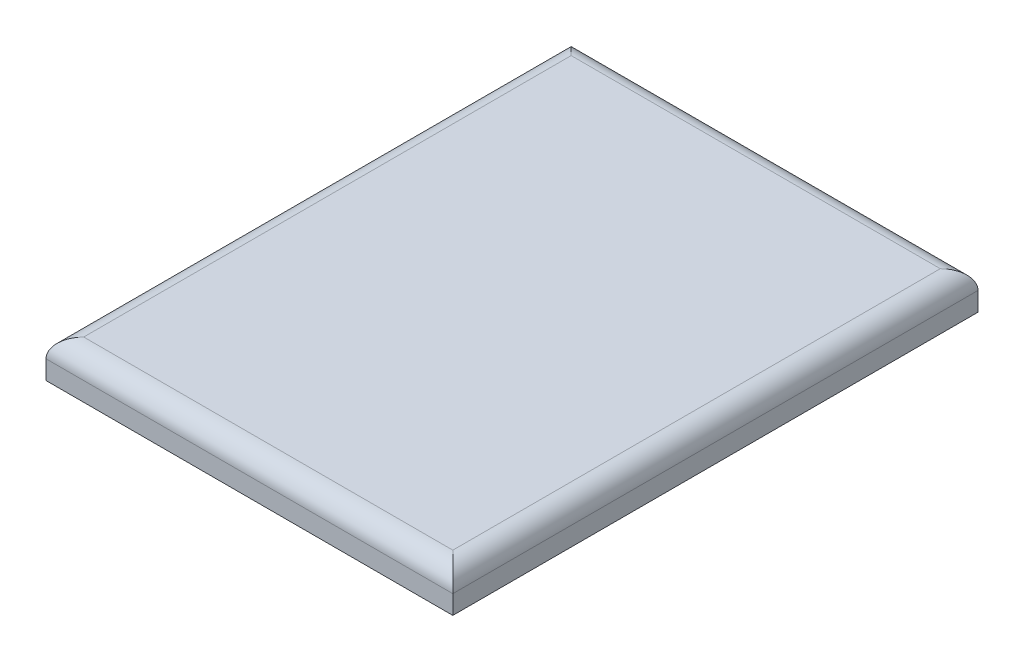
ISO-10303-21;
HEADER;
FILE_DESCRIPTION(('STEP AP214'),'2;1');
FILE_NAME('part.step','',(''),(''),'','','');
FILE_SCHEMA(('AUTOMOTIVE_DESIGN { 1 0 10303 214 1 1 1 1 }'));
ENDSEC;
DATA;
#1=APPLICATION_CONTEXT('core data for automotive mechanical design processes');
#2=APPLICATION_PROTOCOL_DEFINITION('international standard','automotive_design',2000,#1);
#3=PRODUCT_CONTEXT('',#1,'mechanical');
#4=PRODUCT('Part','Part','',(#3));
#5=PRODUCT_RELATED_PRODUCT_CATEGORY('part','',(#4));
#6=PRODUCT_DEFINITION_FORMATION('','',#4);
#7=PRODUCT_DEFINITION_CONTEXT('part definition',#1,'design');
#8=PRODUCT_DEFINITION('design','',#6,#7);
#9=PRODUCT_DEFINITION_SHAPE('','',#8);
#10=(LENGTH_UNIT() NAMED_UNIT(*) SI_UNIT(.MILLI.,.METRE.));
#11=(NAMED_UNIT(*) PLANE_ANGLE_UNIT() SI_UNIT($,.RADIAN.));
#12=(NAMED_UNIT(*) SI_UNIT($,.STERADIAN.) SOLID_ANGLE_UNIT());
#13=UNCERTAINTY_MEASURE_WITH_UNIT(LENGTH_MEASURE(1.E-05),#10,'distance_accuracy_value','');
#14=(GEOMETRIC_REPRESENTATION_CONTEXT(3) GLOBAL_UNCERTAINTY_ASSIGNED_CONTEXT((#13)) GLOBAL_UNIT_ASSIGNED_CONTEXT((#10,
#11,#12)) REPRESENTATION_CONTEXT('',''));
#15=CARTESIAN_POINT('',(0.,0.,0.));
#16=DIRECTION('',(0.,0.,1.));
#17=DIRECTION('',(1.,0.,0.));
#18=AXIS2_PLACEMENT_3D('',#15,#16,#17);
#19=CARTESIAN_POINT('',(215.9,40.0000000000001,278.716444550482));
#20=DIRECTION('',(-1.,0.,0.));
#21=DIRECTION('',(0.,0.,1.));
#22=AXIS2_PLACEMENT_3D('',#19,#20,#21);
#23=PLANE('',#22);
#24=DIRECTION('',(0.,-1.,0.));
#25=VECTOR('',#24,1.);
#26=CARTESIAN_POINT('',(215.9,40.,-278.716444550482));
#27=LINE('',#26,#25);
#28=CARTESIAN_POINT('',(215.9,20.,-278.716444550482));
#29=VERTEX_POINT('',#28);
#30=CARTESIAN_POINT('',(215.9,0.,-278.716444550482));
#31=VERTEX_POINT('',#30);
#32=EDGE_CURVE('E85',#29,#31,#27,.T.);
#33=ORIENTED_EDGE('',*,*,#32,.F.);
#34=DIRECTION('',(0.,0.,-1.));
#35=VECTOR('',#34,1.);
#36=CARTESIAN_POINT('',(215.9,20.,278.716444550482));
#37=LINE('',#36,#35);
#38=CARTESIAN_POINT('',(215.9,20.,278.716444550482));
#39=VERTEX_POINT('',#38);
#40=EDGE_CURVE('E129',#29,#39,#37,.F.);
#41=ORIENTED_EDGE('',*,*,#40,.T.);
#42=DIRECTION('',(0.,-1.,0.));
#43=VECTOR('',#42,1.);
#44=CARTESIAN_POINT('',(215.9,40.0000000000001,278.716444550482));
#45=LINE('',#44,#43);
#46=CARTESIAN_POINT('',(215.9,0.,278.716444550482));
#47=VERTEX_POINT('',#46);
#48=EDGE_CURVE('E105',#39,#47,#45,.T.);
#49=ORIENTED_EDGE('',*,*,#48,.T.);
#50=DIRECTION('',(0.,0.,-1.));
#51=VECTOR('',#50,1.);
#52=CARTESIAN_POINT('',(215.9,0.,278.716444550482));
#53=LINE('',#52,#51);
#54=EDGE_CURVE('E100',#47,#31,#53,.T.);
#55=ORIENTED_EDGE('',*,*,#54,.T.);
#56=EDGE_LOOP('',(#33,#41,#49,#55));
#57=FACE_BOUND('',#56,.T.);
#58=ADVANCED_FACE('F34',(#57),#23,.F.);
#59=CARTESIAN_POINT('',(-215.9,40.,-278.716444550482));
#60=DIRECTION('',(0.,0.,1.));
#61=DIRECTION('',(1.,0.,0.));
#62=AXIS2_PLACEMENT_3D('',#59,#60,#61);
#63=PLANE('',#62);
#64=DIRECTION('',(0.,-1.,0.));
#65=VECTOR('',#64,1.);
#66=CARTESIAN_POINT('',(-215.9,40.,-278.716444550482));
#67=LINE('',#66,#65);
#68=CARTESIAN_POINT('',(-215.9,20.,-278.716444550482));
#69=VERTEX_POINT('',#68);
#70=CARTESIAN_POINT('',(-215.9,0.,-278.716444550482));
#71=VERTEX_POINT('',#70);
#72=EDGE_CURVE('E94',#69,#71,#67,.T.);
#73=ORIENTED_EDGE('',*,*,#72,.F.);
#74=DIRECTION('',(-1.,0.,0.));
#75=VECTOR('',#74,1.);
#76=CARTESIAN_POINT('',(-215.9,20.,-278.716444550482));
#77=LINE('',#76,#75);
#78=EDGE_CURVE('E43',#69,#29,#77,.F.);
#79=ORIENTED_EDGE('',*,*,#78,.T.);
#80=ORIENTED_EDGE('',*,*,#32,.T.);
#81=DIRECTION('',(-1.,0.,0.));
#82=VECTOR('',#81,1.);
#83=CARTESIAN_POINT('',(-215.9,0.,-278.716444550482));
#84=LINE('',#83,#82);
#85=EDGE_CURVE('E88',#31,#71,#84,.T.);
#86=ORIENTED_EDGE('',*,*,#85,.T.);
#87=EDGE_LOOP('',(#73,#79,#80,#86));
#88=FACE_BOUND('',#87,.T.);
#89=ADVANCED_FACE('F87',(#88),#63,.F.);
#90=CARTESIAN_POINT('',(-215.9,40.0000000000001,278.716444550482));
#91=DIRECTION('',(1.,0.,0.));
#92=DIRECTION('',(0.,0.,-1.));
#93=AXIS2_PLACEMENT_3D('',#90,#91,#92);
#94=PLANE('',#93);
#95=DIRECTION('',(0.,-1.,0.));
#96=VECTOR('',#95,1.);
#97=CARTESIAN_POINT('',(-215.9,40.0000000000001,278.716444550482));
#98=LINE('',#97,#96);
#99=CARTESIAN_POINT('',(-215.9,20.,278.716444550482));
#100=VERTEX_POINT('',#99);
#101=CARTESIAN_POINT('',(-215.9,0.,278.716444550482));
#102=VERTEX_POINT('',#101);
#103=EDGE_CURVE('E115',#100,#102,#98,.T.);
#104=ORIENTED_EDGE('',*,*,#103,.F.);
#105=DIRECTION('',(0.,0.,1.));
#106=VECTOR('',#105,1.);
#107=CARTESIAN_POINT('',(-215.9,20.,278.716444550482));
#108=LINE('',#107,#106);
#109=EDGE_CURVE('E11',#100,#69,#108,.F.);
#110=ORIENTED_EDGE('',*,*,#109,.T.);
#111=ORIENTED_EDGE('',*,*,#72,.T.);
#112=DIRECTION('',(0.,0.,1.));
#113=VECTOR('',#112,1.);
#114=CARTESIAN_POINT('',(-215.9,0.,278.716444550482));
#115=LINE('',#114,#113);
#116=EDGE_CURVE('E102',#71,#102,#115,.T.);
#117=ORIENTED_EDGE('',*,*,#116,.T.);
#118=EDGE_LOOP('',(#104,#110,#111,#117));
#119=FACE_BOUND('',#118,.T.);
#120=ADVANCED_FACE('F154',(#119),#94,.F.);
#121=CARTESIAN_POINT('',(-215.9,40.0000000000001,278.716444550482));
#122=DIRECTION('',(0.,0.,-1.));
#123=DIRECTION('',(-1.,0.,0.));
#124=AXIS2_PLACEMENT_3D('',#121,#122,#123);
#125=PLANE('',#124);
#126=ORIENTED_EDGE('',*,*,#48,.F.);
#127=DIRECTION('',(1.,0.,0.));
#128=VECTOR('',#127,1.);
#129=CARTESIAN_POINT('',(-215.9,20.,278.716444550482));
#130=LINE('',#129,#128);
#131=EDGE_CURVE('E126',#39,#100,#130,.F.);
#132=ORIENTED_EDGE('',*,*,#131,.T.);
#133=ORIENTED_EDGE('',*,*,#103,.T.);
#134=DIRECTION('',(1.,0.,0.));
#135=VECTOR('',#134,1.);
#136=CARTESIAN_POINT('',(-215.9,0.,278.716444550482));
#137=LINE('',#136,#135);
#138=EDGE_CURVE('E112',#102,#47,#137,.T.);
#139=ORIENTED_EDGE('',*,*,#138,.T.);
#140=EDGE_LOOP('',(#126,#132,#133,#139));
#141=FACE_BOUND('',#140,.T.);
#142=ADVANCED_FACE('F153',(#141),#125,.F.);
#143=CARTESIAN_POINT('',(0.,40.,0.));
#144=DIRECTION('',(0.,-1.,0.));
#145=DIRECTION('',(0.,0.,-1.));
#146=AXIS2_PLACEMENT_3D('',#143,#144,#145);
#147=PLANE('',#146);
#148=DIRECTION('',(0.,0.,1.));
#149=VECTOR('',#148,1.);
#150=CARTESIAN_POINT('',(-195.9,40.,0.));
#151=LINE('',#150,#149);
#152=CARTESIAN_POINT('',(-195.9,40.,-258.716444550482));
#153=VERTEX_POINT('',#152);
#154=CARTESIAN_POINT('',(-195.9,40.,258.716444550482));
#155=VERTEX_POINT('',#154);
#156=EDGE_CURVE('E93',#153,#155,#151,.T.);
#157=ORIENTED_EDGE('',*,*,#156,.T.);
#158=DIRECTION('',(1.,0.,0.));
#159=VECTOR('',#158,1.);
#160=CARTESIAN_POINT('',(0.,40.,258.716444550482));
#161=LINE('',#160,#159);
#162=CARTESIAN_POINT('',(195.9,40.,258.716444550482));
#163=VERTEX_POINT('',#162);
#164=EDGE_CURVE('E123',#155,#163,#161,.T.);
#165=ORIENTED_EDGE('',*,*,#164,.T.);
#166=DIRECTION('',(0.,0.,-1.));
#167=VECTOR('',#166,1.);
#168=CARTESIAN_POINT('',(195.9,40.,0.));
#169=LINE('',#168,#167);
#170=CARTESIAN_POINT('',(195.9,40.,-258.716444550482));
#171=VERTEX_POINT('',#170);
#172=EDGE_CURVE('E121',#163,#171,#169,.T.);
#173=ORIENTED_EDGE('',*,*,#172,.T.);
#174=DIRECTION('',(-1.,0.,0.));
#175=VECTOR('',#174,1.);
#176=CARTESIAN_POINT('',(0.,40.,-258.716444550482));
#177=LINE('',#176,#175);
#178=EDGE_CURVE('E119',#171,#153,#177,.T.);
#179=ORIENTED_EDGE('',*,*,#178,.T.);
#180=EDGE_LOOP('',(#157,#165,#173,#179));
#181=FACE_BOUND('',#180,.T.);
#182=ADVANCED_FACE('F146',(#181),#147,.F.);
#183=CARTESIAN_POINT('',(0.,0.,0.));
#184=DIRECTION('',(0.,-1.,0.));
#185=DIRECTION('',(0.,0.,-1.));
#186=AXIS2_PLACEMENT_3D('',#183,#184,#185);
#187=PLANE('',#186);
#188=ORIENTED_EDGE('',*,*,#54,.F.);
#189=ORIENTED_EDGE('',*,*,#138,.F.);
#190=ORIENTED_EDGE('',*,*,#116,.F.);
#191=ORIENTED_EDGE('',*,*,#85,.F.);
#192=EDGE_LOOP('',(#188,#189,#190,#191));
#193=FACE_BOUND('',#192,.T.);
#194=ADVANCED_FACE('F98',(#193),#187,.T.);
#195=CARTESIAN_POINT('',(0.,20.,-258.716444550482));
#196=DIRECTION('',(-1.,0.,0.));
#197=DIRECTION('',(0.,0.,1.));
#198=AXIS2_PLACEMENT_3D('',#195,#196,#197);
#199=CYLINDRICAL_SURFACE('',#198,20.);
#200=CARTESIAN_POINT('',(195.9,20.,-258.716444550482));
#201=DIRECTION('',(-0.707106781186547,0.,-0.707106781186548));
#202=DIRECTION('',(-0.707106781186547,0.,0.707106781186548));
#203=AXIS2_PLACEMENT_3D('',#200,#201,#202);
#204=ELLIPSE('',#203,28.2842712474619,20.);
#205=EDGE_CURVE('E109',#29,#171,#204,.F.);
#206=ORIENTED_EDGE('',*,*,#205,.F.);
#207=ORIENTED_EDGE('',*,*,#78,.F.);
#208=CARTESIAN_POINT('',(-195.9,20.,-258.716444550482));
#209=DIRECTION('',(-0.707106781186547,0.,0.707106781186548));
#210=DIRECTION('',(0.707106781186547,0.,0.707106781186548));
#211=AXIS2_PLACEMENT_3D('',#208,#209,#210);
#212=ELLIPSE('',#211,28.2842712474619,20.);
#213=EDGE_CURVE('E38',#153,#69,#212,.T.);
#214=ORIENTED_EDGE('',*,*,#213,.F.);
#215=ORIENTED_EDGE('',*,*,#178,.F.);
#216=EDGE_LOOP('',(#206,#207,#214,#215));
#217=FACE_BOUND('',#216,.T.);
#218=ADVANCED_FACE('F36',(#217),#199,.T.);
#219=CARTESIAN_POINT('',(-195.9,20.,0.));
#220=DIRECTION('',(0.,0.,1.));
#221=DIRECTION('',(1.,0.,0.));
#222=AXIS2_PLACEMENT_3D('',#219,#220,#221);
#223=CYLINDRICAL_SURFACE('',#222,20.);
#224=ORIENTED_EDGE('',*,*,#213,.T.);
#225=ORIENTED_EDGE('',*,*,#109,.F.);
#226=CARTESIAN_POINT('',(-195.9,20.,258.716444550482));
#227=DIRECTION('',(0.707106781186547,0.,0.707106781186548));
#228=DIRECTION('',(-0.707106781186547,0.,0.707106781186548));
#229=AXIS2_PLACEMENT_3D('',#226,#227,#228);
#230=ELLIPSE('',#229,28.2842712474619,20.);
#231=EDGE_CURVE('E134',#155,#100,#230,.T.);
#232=ORIENTED_EDGE('',*,*,#231,.F.);
#233=ORIENTED_EDGE('',*,*,#156,.F.);
#234=EDGE_LOOP('',(#224,#225,#232,#233));
#235=FACE_BOUND('',#234,.T.);
#236=ADVANCED_FACE('F171',(#235),#223,.T.);
#237=CARTESIAN_POINT('',(195.9,20.,0.));
#238=DIRECTION('',(0.,0.,-1.));
#239=DIRECTION('',(-1.,0.,0.));
#240=AXIS2_PLACEMENT_3D('',#237,#238,#239);
#241=CYLINDRICAL_SURFACE('',#240,20.);
#242=ORIENTED_EDGE('',*,*,#205,.T.);
#243=ORIENTED_EDGE('',*,*,#172,.F.);
#244=CARTESIAN_POINT('',(195.9,20.,258.716444550482));
#245=DIRECTION('',(0.707106781186547,0.,-0.707106781186548));
#246=DIRECTION('',(-0.707106781186547,0.,-0.707106781186548));
#247=AXIS2_PLACEMENT_3D('',#244,#245,#246);
#248=ELLIPSE('',#247,28.2842712474619,20.);
#249=EDGE_CURVE('E132',#39,#163,#248,.F.);
#250=ORIENTED_EDGE('',*,*,#249,.F.);
#251=ORIENTED_EDGE('',*,*,#40,.F.);
#252=EDGE_LOOP('',(#242,#243,#250,#251));
#253=FACE_BOUND('',#252,.T.);
#254=ADVANCED_FACE('F139',(#253),#241,.T.);
#255=CARTESIAN_POINT('',(0.,20.,258.716444550482));
#256=DIRECTION('',(1.,0.,0.));
#257=DIRECTION('',(0.,0.,-1.));
#258=AXIS2_PLACEMENT_3D('',#255,#256,#257);
#259=CYLINDRICAL_SURFACE('',#258,20.);
#260=ORIENTED_EDGE('',*,*,#231,.T.);
#261=ORIENTED_EDGE('',*,*,#131,.F.);
#262=ORIENTED_EDGE('',*,*,#249,.T.);
#263=ORIENTED_EDGE('',*,*,#164,.F.);
#264=EDGE_LOOP('',(#260,#261,#262,#263));
#265=FACE_BOUND('',#264,.T.);
#266=ADVANCED_FACE('F150',(#265),#259,.T.);
#267=CLOSED_SHELL('',(#58,#89,#120,#142,#182,#194,#218,#236,#254,#266));
#268=MANIFOLD_SOLID_BREP('B2',#267);
#269=ADVANCED_BREP_SHAPE_REPRESENTATION('',(#18,#268),#14);
#270=SHAPE_DEFINITION_REPRESENTATION(#9,#269);
ENDSEC;
END-ISO-10303-21;
